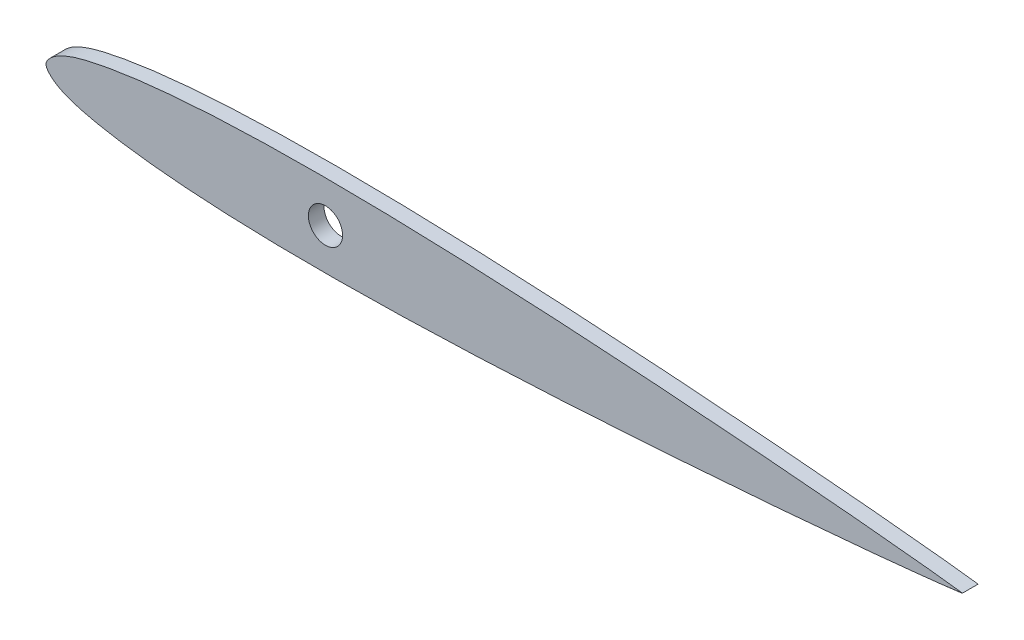
ISO-10303-21;
HEADER;
FILE_DESCRIPTION(('STEP AP214'),'2;1');
FILE_NAME('part.step','',(''),(''),'','','');
FILE_SCHEMA(('AUTOMOTIVE_DESIGN { 1 0 10303 214 1 1 1 1 }'));
ENDSEC;
DATA;
#1=APPLICATION_CONTEXT('core data for automotive mechanical design processes');
#2=APPLICATION_PROTOCOL_DEFINITION('international standard','automotive_design',2000,#1);
#3=PRODUCT_CONTEXT('',#1,'mechanical');
#4=PRODUCT('Part','Part','',(#3));
#5=PRODUCT_RELATED_PRODUCT_CATEGORY('part','',(#4));
#6=PRODUCT_DEFINITION_FORMATION('','',#4);
#7=PRODUCT_DEFINITION_CONTEXT('part definition',#1,'design');
#8=PRODUCT_DEFINITION('design','',#6,#7);
#9=PRODUCT_DEFINITION_SHAPE('','',#8);
#10=(LENGTH_UNIT() NAMED_UNIT(*) SI_UNIT(.MILLI.,.METRE.));
#11=(NAMED_UNIT(*) PLANE_ANGLE_UNIT() SI_UNIT($,.RADIAN.));
#12=(NAMED_UNIT(*) SI_UNIT($,.STERADIAN.) SOLID_ANGLE_UNIT());
#13=UNCERTAINTY_MEASURE_WITH_UNIT(LENGTH_MEASURE(1.E-05),#10,'distance_accuracy_value','');
#14=(GEOMETRIC_REPRESENTATION_CONTEXT(3) GLOBAL_UNCERTAINTY_ASSIGNED_CONTEXT((#13)) GLOBAL_UNIT_ASSIGNED_CONTEXT((#10,
#11,#12)) REPRESENTATION_CONTEXT('',''));
#15=CARTESIAN_POINT('',(0.,0.,0.));
#16=DIRECTION('',(0.,0.,1.));
#17=DIRECTION('',(1.,0.,0.));
#18=AXIS2_PLACEMENT_3D('',#15,#16,#17);
#19=CARTESIAN_POINT('',(133.858,0.,2.286));
#20=CARTESIAN_POINT('',(133.858000000006,0.025572352081566,2.286));
#21=CARTESIAN_POINT('',(132.635239994895,0.127315723893167,2.286));
#22=CARTESIAN_POINT('',(131.381173106276,0.339626329426729,2.286));
#23=CARTESIAN_POINT('',(128.334953603946,0.665115733575434,2.286));
#24=CARTESIAN_POINT('',(124.592239149143,1.06914047249353,2.286));
#25=CARTESIAN_POINT('',(119.715507643787,1.54326007619425,2.286));
#26=CARTESIAN_POINT('',(113.989956530878,2.06648210627225,2.286));
#27=CARTESIAN_POINT('',(107.440636520153,2.62870278752321,2.286));
#28=CARTESIAN_POINT('',(100.204596194085,3.21347035648728,2.286));
#29=CARTESIAN_POINT('',(92.397202136374,3.79742729289213,2.286));
#30=CARTESIAN_POINT('',(84.1545880867161,4.36327057560728,2.286));
#31=CARTESIAN_POINT('',(75.6171940837196,4.88496292152431,2.286));
#32=CARTESIAN_POINT('',(66.9311998096909,5.34041153125693,2.286));
#33=CARTESIAN_POINT('',(58.2449138974531,5.70254244928646,2.286));
#34=CARTESIAN_POINT('',(51.0726177823776,5.91173943716512,2.286));
#35=CARTESIAN_POINT('',(45.4463596762667,6.0078430649406,2.286));
#36=CARTESIAN_POINT('',(41.3532701766978,6.04194979941246,2.286));
#37=CARTESIAN_POINT('',(37.369416298685,6.03718550610148,2.286));
#38=CARTESIAN_POINT('',(33.5118372205296,5.98590262113425,2.286));
#39=CARTESIAN_POINT('',(29.7973522340072,5.89588412288079,2.286));
#40=CARTESIAN_POINT('',(26.2421744999696,5.75993669881171,2.286));
#41=CARTESIAN_POINT('',(22.8612457530526,5.58301050883047,2.286));
#42=CARTESIAN_POINT('',(19.6685964297222,5.36098124440595,2.286));
#43=CARTESIAN_POINT('',(16.6777641276208,5.09760583245151,2.286));
#44=CARTESIAN_POINT('',(13.9025226364826,4.79057825251858,2.286));
#45=CARTESIAN_POINT('',(11.3544396865246,4.44575169458695,2.286));
#46=CARTESIAN_POINT('',(9.04347840167528,4.0720155242444,2.286));
#47=CARTESIAN_POINT('',(6.97926327189238,3.67104369469383,2.286));
#48=CARTESIAN_POINT('',(5.16849998283899,3.24422580466831,2.286));
#49=CARTESIAN_POINT('',(3.61976357763527,2.77718790177075,2.286));
#50=CARTESIAN_POINT('',(2.33641563214279,2.26127952664189,2.286));
#51=CARTESIAN_POINT('',(1.33019865423671,1.69204562324609,2.286));
#52=CARTESIAN_POINT('',(0.606605893496202,1.09763980354831,2.286));
#53=CARTESIAN_POINT('',(0.154717171863237,0.552843267655984,2.286));
#54=CARTESIAN_POINT('',(-0.0633102416850822,3.01443884090045E-08,2.286));
#55=CARTESIAN_POINT('',(0.154717171614367,-0.552843207465403,2.286));
#56=CARTESIAN_POINT('',(0.606605893002044,-1.09763974356111,2.286));
#57=CARTESIAN_POINT('',(1.33019865347502,-1.69204556358469,2.286));
#58=CARTESIAN_POINT('',(2.33641563112479,-2.26127946743343,2.286));
#59=CARTESIAN_POINT('',(3.61976357638505,-2.77718784314004,2.286));
#60=CARTESIAN_POINT('',(5.16849998137848,-3.24422574673481,2.286));
#61=CARTESIAN_POINT('',(6.97926327023977,-3.67104363757551,2.286));
#62=CARTESIAN_POINT('',(9.04347839984211,-4.07201546805534,2.286));
#63=CARTESIAN_POINT('',(11.3544396845232,-4.44575163943824,2.286));
#64=CARTESIAN_POINT('',(13.902522634326,-4.79057819851697,2.286));
#65=CARTESIAN_POINT('',(16.677764125326,-5.09760577969925,2.286));
#66=CARTESIAN_POINT('',(19.6685964273089,-5.36098119300011,2.286));
#67=CARTESIAN_POINT('',(22.8612457505392,-5.5830104588619,2.286));
#68=CARTESIAN_POINT('',(26.2421744973766,-5.75993665036517,2.286));
#69=CARTESIAN_POINT('',(29.7973522313529,-5.89588407603472,2.286));
#70=CARTESIAN_POINT('',(33.5118372178349,-5.98590257596037,2.286));
#71=CARTESIAN_POINT('',(37.3694162959672,-6.0371854626642,2.286));
#72=CARTESIAN_POINT('',(41.3532701739779,-6.04194975776863,2.286));
#73=CARTESIAN_POINT('',(45.4463596735621,-6.00784302513942,2.286));
#74=CARTESIAN_POINT('',(51.0726177797163,-5.91173939989676,2.286));
#75=CARTESIAN_POINT('',(58.2449138948859,-5.70254241524693,2.286));
#76=CARTESIAN_POINT('',(66.9311998072867,-5.34041150112779,2.286));
#77=CARTESIAN_POINT('',(75.6171940815205,-4.88496289530543,2.286));
#78=CARTESIAN_POINT('',(84.1545880847518,-4.36327055323178,2.286));
#79=CARTESIAN_POINT('',(92.3972021346645,-3.79742727422729,2.286));
#80=CARTESIAN_POINT('',(100.204596192638,-3.21347034133717,2.286));
#81=CARTESIAN_POINT('',(107.44063651897,-2.62870277563063,2.286));
#82=CARTESIAN_POINT('',(113.989956529947,-2.06648209732804,2.286));
#83=CARTESIAN_POINT('',(119.715507643092,-1.54326006982758,2.286));
#84=CARTESIAN_POINT('',(124.592239148662,-1.06914046832227,2.286));
#85=CARTESIAN_POINT('',(128.334953603647,-0.665115731089063,2.286));
#86=CARTESIAN_POINT('',(131.381173106123,-0.339626328311714,2.286));
#87=CARTESIAN_POINT('',(132.635239994838,-0.127315723342702,2.286));
#88=CARTESIAN_POINT('',(133.857999999994,-0.0255723520815676,2.286));
#89=CARTESIAN_POINT('',(133.858,0.,2.286));
#90=B_SPLINE_CURVE_WITH_KNOTS('',3,(#19,#20,#21,#22,#23,#24,#25,#26,#27,#28,#29,#30,#31,#32,#33,
#34,#35,#36,#37,#38,#39,#40,#41,#42,#43,#44,#45,#46,#47,#48,#49,#50,#51,#52,#53,#54,#55,#56,#57,
#58,#59,#60,#61,#62,#63,#64,#65,#66,#67,#68,#69,#70,#71,#72,#73,#74,#75,#76,#77,#78,#79,#80,#81,
#82,#83,#84,#85,#86,#87,#88,#89),.UNSPECIFIED.,.T.,.F.,(4,1,1,1,1,1,1,1,1,1,1,1,1,1,1,1,1,1,1,1,
1,1,1,1,1,1,1,1,1,1,1,1,1,1,1,1,1,1,1,1,1,1,1,1,1,1,1,1,1,1,1,1,1,1,1,1,1,1,1,1,1,1,1,1,1,1,1,1,
4),(0.,0.00213342749536812,0.00848815570874326,0.0189444871418497,0.033319113775561,
0.0513562940971698,0.0727560928984786,0.0971408174352606,0.124097488782512,0.153162556777752,
0.183833917661664,0.21558937445911,0.247878194577004,0.280150867864074,0.311860397032406,
0.327332942728477,0.342462846119516,0.35718710244681,0.371448118351621,0.385183441042633,
0.398331272584713,0.410844637191414,0.422672607167312,0.433769314473499,0.444090175228778,
0.453589411782157,0.462240439844477,0.470010037325291,0.476870984677,0.482833353063501,
0.487908551351284,0.492155163583175,0.495592273393841,0.498196358984712,0.5,0.501803641015288,
0.504407726606159,0.507844836416825,0.512091448648716,0.517166646936499,0.523129015323001,
0.529989962674709,0.537759560155523,0.546410588217844,0.555909824771222,0.566230685526501,
0.577327392832688,0.589155362808586,0.601668727415287,0.614816558957367,0.628551881648379,
0.64281289755319,0.657537153880484,0.672667057271523,0.688139602967594,0.719849132135926,
0.752121805422996,0.78441062554089,0.816166082338336,0.846837443222248,0.875902511217488,
0.902859182564739,0.927243907101521,0.94864370590283,0.966680886224439,0.98105551285815,
0.991511844291257,0.997866572504632,1.),.UNSPECIFIED.);
#91=DIRECTION('',(0.,0.,-1.));
#92=VECTOR('',#91,1.);
#93=SURFACE_OF_LINEAR_EXTRUSION('',#90,#92);
#94=CARTESIAN_POINT('',(133.858,0.,2.286));
#95=VERTEX_POINT('',#94);
#96=EDGE_CURVE('E10',#95,#95,#90,.T.);
#97=ORIENTED_EDGE('',*,*,#96,.F.);
#98=EDGE_LOOP('',(#97));
#99=FACE_BOUND('',#98,.T.);
#100=CARTESIAN_POINT('',(133.858,0.,0.));
#101=CARTESIAN_POINT('',(133.858000000006,0.025572352081566,0.));
#102=CARTESIAN_POINT('',(132.635239994895,0.127315723893167,0.));
#103=CARTESIAN_POINT('',(131.381173106276,0.339626329426729,0.));
#104=CARTESIAN_POINT('',(128.334953603946,0.665115733575434,0.));
#105=CARTESIAN_POINT('',(124.592239149143,1.06914047249353,0.));
#106=CARTESIAN_POINT('',(119.715507643787,1.54326007619425,0.));
#107=CARTESIAN_POINT('',(113.989956530878,2.06648210627225,0.));
#108=CARTESIAN_POINT('',(107.440636520153,2.62870278752321,0.));
#109=CARTESIAN_POINT('',(100.204596194085,3.21347035648728,0.));
#110=CARTESIAN_POINT('',(92.397202136374,3.79742729289213,0.));
#111=CARTESIAN_POINT('',(84.1545880867161,4.36327057560728,0.));
#112=CARTESIAN_POINT('',(75.6171940837196,4.88496292152431,0.));
#113=CARTESIAN_POINT('',(66.9311998096909,5.34041153125693,0.));
#114=CARTESIAN_POINT('',(58.2449138974531,5.70254244928646,0.));
#115=CARTESIAN_POINT('',(51.0726177823776,5.91173943716512,0.));
#116=CARTESIAN_POINT('',(45.4463596762667,6.0078430649406,0.));
#117=CARTESIAN_POINT('',(41.3532701766978,6.04194979941246,0.));
#118=CARTESIAN_POINT('',(37.369416298685,6.03718550610148,0.));
#119=CARTESIAN_POINT('',(33.5118372205296,5.98590262113425,0.));
#120=CARTESIAN_POINT('',(29.7973522340072,5.89588412288079,0.));
#121=CARTESIAN_POINT('',(26.2421744999696,5.75993669881171,0.));
#122=CARTESIAN_POINT('',(22.8612457530526,5.58301050883047,0.));
#123=CARTESIAN_POINT('',(19.6685964297222,5.36098124440595,0.));
#124=CARTESIAN_POINT('',(16.6777641276208,5.09760583245151,0.));
#125=CARTESIAN_POINT('',(13.9025226364826,4.79057825251858,0.));
#126=CARTESIAN_POINT('',(11.3544396865246,4.44575169458695,0.));
#127=CARTESIAN_POINT('',(9.04347840167528,4.0720155242444,0.));
#128=CARTESIAN_POINT('',(6.97926327189238,3.67104369469383,0.));
#129=CARTESIAN_POINT('',(5.16849998283899,3.24422580466831,0.));
#130=CARTESIAN_POINT('',(3.61976357763527,2.77718790177075,0.));
#131=CARTESIAN_POINT('',(2.33641563214279,2.26127952664189,0.));
#132=CARTESIAN_POINT('',(1.33019865423671,1.69204562324609,0.));
#133=CARTESIAN_POINT('',(0.606605893496202,1.09763980354831,0.));
#134=CARTESIAN_POINT('',(0.154717171863237,0.552843267655984,0.));
#135=CARTESIAN_POINT('',(-0.0633102416850822,3.01443884090045E-08,0.));
#136=CARTESIAN_POINT('',(0.154717171614367,-0.552843207465403,0.));
#137=CARTESIAN_POINT('',(0.606605893002044,-1.09763974356111,0.));
#138=CARTESIAN_POINT('',(1.33019865347502,-1.69204556358469,0.));
#139=CARTESIAN_POINT('',(2.33641563112479,-2.26127946743343,0.));
#140=CARTESIAN_POINT('',(3.61976357638505,-2.77718784314004,0.));
#141=CARTESIAN_POINT('',(5.16849998137848,-3.24422574673481,0.));
#142=CARTESIAN_POINT('',(6.97926327023977,-3.67104363757551,0.));
#143=CARTESIAN_POINT('',(9.04347839984211,-4.07201546805534,0.));
#144=CARTESIAN_POINT('',(11.3544396845232,-4.44575163943824,0.));
#145=CARTESIAN_POINT('',(13.902522634326,-4.79057819851697,0.));
#146=CARTESIAN_POINT('',(16.677764125326,-5.09760577969925,0.));
#147=CARTESIAN_POINT('',(19.6685964273089,-5.36098119300011,0.));
#148=CARTESIAN_POINT('',(22.8612457505392,-5.5830104588619,0.));
#149=CARTESIAN_POINT('',(26.2421744973766,-5.75993665036517,0.));
#150=CARTESIAN_POINT('',(29.7973522313529,-5.89588407603472,0.));
#151=CARTESIAN_POINT('',(33.5118372178349,-5.98590257596037,0.));
#152=CARTESIAN_POINT('',(37.3694162959672,-6.0371854626642,0.));
#153=CARTESIAN_POINT('',(41.3532701739779,-6.04194975776863,0.));
#154=CARTESIAN_POINT('',(45.4463596735621,-6.00784302513942,0.));
#155=CARTESIAN_POINT('',(51.0726177797163,-5.91173939989676,0.));
#156=CARTESIAN_POINT('',(58.2449138948859,-5.70254241524693,0.));
#157=CARTESIAN_POINT('',(66.9311998072867,-5.34041150112779,0.));
#158=CARTESIAN_POINT('',(75.6171940815205,-4.88496289530543,0.));
#159=CARTESIAN_POINT('',(84.1545880847518,-4.36327055323178,0.));
#160=CARTESIAN_POINT('',(92.3972021346645,-3.79742727422729,0.));
#161=CARTESIAN_POINT('',(100.204596192638,-3.21347034133717,0.));
#162=CARTESIAN_POINT('',(107.44063651897,-2.62870277563063,0.));
#163=CARTESIAN_POINT('',(113.989956529947,-2.06648209732804,0.));
#164=CARTESIAN_POINT('',(119.715507643092,-1.54326006982758,0.));
#165=CARTESIAN_POINT('',(124.592239148662,-1.06914046832227,0.));
#166=CARTESIAN_POINT('',(128.334953603647,-0.665115731089063,0.));
#167=CARTESIAN_POINT('',(131.381173106123,-0.339626328311714,0.));
#168=CARTESIAN_POINT('',(132.635239994838,-0.127315723342702,0.));
#169=CARTESIAN_POINT('',(133.857999999994,-0.0255723520815676,0.));
#170=CARTESIAN_POINT('',(133.858,0.,0.));
#171=B_SPLINE_CURVE_WITH_KNOTS('',3,(#100,#101,#102,#103,#104,#105,#106,#107,#108,#109,#110,
#111,#112,#113,#114,#115,#116,#117,#118,#119,#120,#121,#122,#123,#124,#125,#126,#127,#128,#129,
#130,#131,#132,#133,#134,#135,#136,#137,#138,#139,#140,#141,#142,#143,#144,#145,#146,#147,#148,
#149,#150,#151,#152,#153,#154,#155,#156,#157,#158,#159,#160,#161,#162,#163,#164,#165,#166,#167,
#168,#169,#170),.UNSPECIFIED.,.T.,.F.,(4,1,1,1,1,1,1,1,1,1,1,1,1,1,1,1,1,1,1,1,1,1,1,1,1,1,1,1,
1,1,1,1,1,1,1,1,1,1,1,1,1,1,1,1,1,1,1,1,1,1,1,1,1,1,1,1,1,1,1,1,1,1,1,1,1,1,1,1,4),(0.,
0.00213342749536812,0.00848815570874326,0.0189444871418497,0.033319113775561,0.0513562940971698,
0.0727560928984786,0.0971408174352606,0.124097488782512,0.153162556777752,0.183833917661664,
0.21558937445911,0.247878194577004,0.280150867864074,0.311860397032406,0.327332942728477,
0.342462846119516,0.35718710244681,0.371448118351621,0.385183441042633,0.398331272584713,
0.410844637191414,0.422672607167312,0.433769314473499,0.444090175228778,0.453589411782157,
0.462240439844477,0.470010037325291,0.476870984677,0.482833353063501,0.487908551351284,
0.492155163583175,0.495592273393841,0.498196358984712,0.5,0.501803641015288,0.504407726606159,
0.507844836416825,0.512091448648716,0.517166646936499,0.523129015323001,0.529989962674709,
0.537759560155523,0.546410588217844,0.555909824771222,0.566230685526501,0.577327392832688,
0.589155362808586,0.601668727415287,0.614816558957367,0.628551881648379,0.64281289755319,
0.657537153880484,0.672667057271523,0.688139602967594,0.719849132135926,0.752121805422996,
0.78441062554089,0.816166082338336,0.846837443222248,0.875902511217488,0.902859182564739,
0.927243907101521,0.94864370590283,0.966680886224439,0.98105551285815,0.991511844291257,
0.997866572504632,1.),.UNSPECIFIED.);
#172=CARTESIAN_POINT('',(133.858,0.,0.));
#173=VERTEX_POINT('',#172);
#174=EDGE_CURVE('E34',#173,#173,#171,.T.);
#175=ORIENTED_EDGE('',*,*,#174,.T.);
#176=EDGE_LOOP('',(#175));
#177=FACE_BOUND('',#176,.T.);
#178=ADVANCED_FACE('F30',(#99,#177),#93,.F.);
#179=CARTESIAN_POINT('',(0.,3.0130156970331E-08,2.286));
#180=DIRECTION('',(0.,0.,-1.));
#181=DIRECTION('',(-1.,0.,0.));
#182=AXIS2_PLACEMENT_3D('',#179,#180,#181);
#183=PLANE('',#182);
#184=CARTESIAN_POINT('',(40.82669,0.,2.286));
#185=DIRECTION('',(0.,0.,1.));
#186=DIRECTION('',(1.,0.,0.));
#187=AXIS2_PLACEMENT_3D('',#184,#185,#186);
#188=CIRCLE('',#187,2.499995);
#189=CARTESIAN_POINT('',(43.326685,0.,2.286));
#190=VERTEX_POINT('',#189);
#191=EDGE_CURVE('E47',#190,#190,#188,.T.);
#192=ORIENTED_EDGE('',*,*,#191,.F.);
#193=EDGE_LOOP('',(#192));
#194=FACE_BOUND('',#193,.T.);
#195=ORIENTED_EDGE('',*,*,#96,.T.);
#196=EDGE_LOOP('',(#195));
#197=FACE_BOUND('',#196,.T.);
#198=ADVANCED_FACE('F65',(#194,#197),#183,.F.);
#199=CARTESIAN_POINT('',(0.,3.0130156970331E-08,0.));
#200=DIRECTION('',(0.,0.,-1.));
#201=DIRECTION('',(-1.,0.,0.));
#202=AXIS2_PLACEMENT_3D('',#199,#200,#201);
#203=PLANE('',#202);
#204=CARTESIAN_POINT('',(40.82669,0.,0.));
#205=DIRECTION('',(0.,0.,1.));
#206=DIRECTION('',(1.,0.,0.));
#207=AXIS2_PLACEMENT_3D('',#204,#205,#206);
#208=CIRCLE('',#207,2.499995);
#209=CARTESIAN_POINT('',(43.326685,0.,0.));
#210=VERTEX_POINT('',#209);
#211=EDGE_CURVE('E42',#210,#210,#208,.T.);
#212=ORIENTED_EDGE('',*,*,#211,.T.);
#213=EDGE_LOOP('',(#212));
#214=FACE_BOUND('',#213,.T.);
#215=ORIENTED_EDGE('',*,*,#174,.F.);
#216=EDGE_LOOP('',(#215));
#217=FACE_BOUND('',#216,.T.);
#218=ADVANCED_FACE('F56',(#214,#217),#203,.T.);
#219=CARTESIAN_POINT('',(40.82669,0.,0.));
#220=DIRECTION('',(0.,0.,1.));
#221=DIRECTION('',(1.,0.,0.));
#222=AXIS2_PLACEMENT_3D('',#219,#220,#221);
#223=CYLINDRICAL_SURFACE('',#222,2.499995);
#224=ORIENTED_EDGE('',*,*,#211,.F.);
#225=EDGE_LOOP('',(#224));
#226=FACE_BOUND('',#225,.T.);
#227=ORIENTED_EDGE('',*,*,#191,.T.);
#228=EDGE_LOOP('',(#227));
#229=FACE_BOUND('',#228,.T.);
#230=ADVANCED_FACE('F59',(#226,#229),#223,.F.);
#231=CLOSED_SHELL('',(#178,#198,#218,#230));
#232=MANIFOLD_SOLID_BREP('B2',#231);
#233=ADVANCED_BREP_SHAPE_REPRESENTATION('',(#18,#232),#14);
#234=SHAPE_DEFINITION_REPRESENTATION(#9,#233);
ENDSEC;
END-ISO-10303-21;
